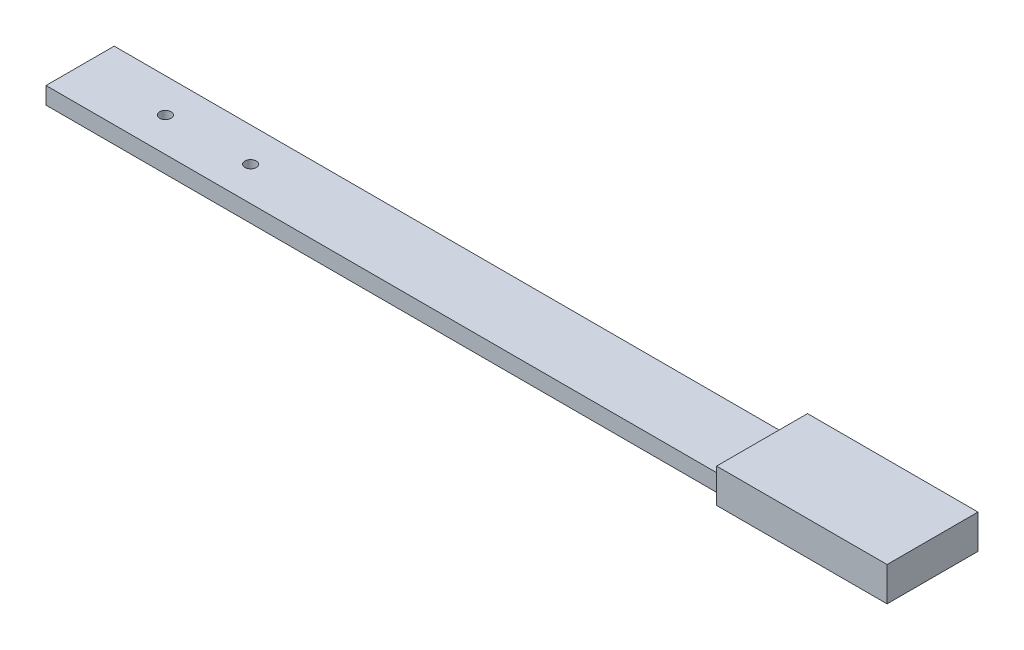
ISO-10303-21;
HEADER;
FILE_DESCRIPTION(('STEP AP214'),'2;1');
FILE_NAME('part.step','',(''),(''),'','','');
FILE_SCHEMA(('AUTOMOTIVE_DESIGN { 1 0 10303 214 1 1 1 1 }'));
ENDSEC;
DATA;
#1=APPLICATION_CONTEXT('core data for automotive mechanical design processes');
#2=APPLICATION_PROTOCOL_DEFINITION('international standard','automotive_design',2000,#1);
#3=PRODUCT_CONTEXT('',#1,'mechanical');
#4=PRODUCT('Part','Part','',(#3));
#5=PRODUCT_RELATED_PRODUCT_CATEGORY('part','',(#4));
#6=PRODUCT_DEFINITION_FORMATION('','',#4);
#7=PRODUCT_DEFINITION_CONTEXT('part definition',#1,'design');
#8=PRODUCT_DEFINITION('design','',#6,#7);
#9=PRODUCT_DEFINITION_SHAPE('','',#8);
#10=(LENGTH_UNIT() NAMED_UNIT(*) SI_UNIT(.MILLI.,.METRE.));
#11=(NAMED_UNIT(*) PLANE_ANGLE_UNIT() SI_UNIT($,.RADIAN.));
#12=(NAMED_UNIT(*) SI_UNIT($,.STERADIAN.) SOLID_ANGLE_UNIT());
#13=UNCERTAINTY_MEASURE_WITH_UNIT(LENGTH_MEASURE(1.E-05),#10,'distance_accuracy_value','');
#14=(GEOMETRIC_REPRESENTATION_CONTEXT(3) GLOBAL_UNCERTAINTY_ASSIGNED_CONTEXT((#13)) GLOBAL_UNIT_ASSIGNED_CONTEXT((#10,
#11,#12)) REPRESENTATION_CONTEXT('',''));
#15=CARTESIAN_POINT('',(0.,0.,0.));
#16=DIRECTION('',(0.,0.,1.));
#17=DIRECTION('',(1.,0.,0.));
#18=AXIS2_PLACEMENT_3D('',#15,#16,#17);
#19=CARTESIAN_POINT('',(-375.,-30.,40.));
#20=DIRECTION('',(0.,0.,1.));
#21=DIRECTION('',(1.,0.,0.));
#22=AXIS2_PLACEMENT_3D('',#19,#20,#21);
#23=PLANE('',#22);
#24=DIRECTION('',(1.,0.,0.));
#25=VECTOR('',#24,1.);
#26=CARTESIAN_POINT('',(-375.,0.,40.));
#27=LINE('',#26,#25);
#28=CARTESIAN_POINT('',(225.,0.,40.));
#29=VERTEX_POINT('',#28);
#30=CARTESIAN_POINT('',(375.,0.,40.));
#31=VERTEX_POINT('',#30);
#32=EDGE_CURVE('E70',#29,#31,#27,.T.);
#33=ORIENTED_EDGE('',*,*,#32,.F.);
#34=DIRECTION('',(0.,1.,0.));
#35=VECTOR('',#34,1.);
#36=CARTESIAN_POINT('',(225.,-30.,40.));
#37=LINE('',#36,#35);
#38=CARTESIAN_POINT('',(225.,-30.,40.));
#39=VERTEX_POINT('',#38);
#40=EDGE_CURVE('E49',#39,#29,#37,.T.);
#41=ORIENTED_EDGE('',*,*,#40,.F.);
#42=DIRECTION('',(1.,0.,0.));
#43=VECTOR('',#42,1.);
#44=CARTESIAN_POINT('',(-375.,-30.,40.));
#45=LINE('',#44,#43);
#46=CARTESIAN_POINT('',(375.,-30.,40.));
#47=VERTEX_POINT('',#46);
#48=EDGE_CURVE('E56',#39,#47,#45,.T.);
#49=ORIENTED_EDGE('',*,*,#48,.T.);
#50=DIRECTION('',(0.,1.,0.));
#51=VECTOR('',#50,1.);
#52=CARTESIAN_POINT('',(375.,-30.,40.));
#53=LINE('',#52,#51);
#54=EDGE_CURVE('E11',#47,#31,#53,.T.);
#55=ORIENTED_EDGE('',*,*,#54,.T.);
#56=EDGE_LOOP('',(#33,#41,#49,#55));
#57=FACE_BOUND('',#56,.T.);
#58=ADVANCED_FACE('F32',(#57),#23,.T.);
#59=CARTESIAN_POINT('',(-375.,-30.,-40.));
#60=DIRECTION('',(0.,0.,-1.));
#61=DIRECTION('',(-1.,0.,0.));
#62=AXIS2_PLACEMENT_3D('',#59,#60,#61);
#63=PLANE('',#62);
#64=DIRECTION('',(-1.,0.,0.));
#65=VECTOR('',#64,1.);
#66=CARTESIAN_POINT('',(-375.,-30.,-40.));
#67=LINE('',#66,#65);
#68=CARTESIAN_POINT('',(375.,-30.,-40.));
#69=VERTEX_POINT('',#68);
#70=CARTESIAN_POINT('',(225.,-30.,-40.));
#71=VERTEX_POINT('',#70);
#72=EDGE_CURVE('E93',#69,#71,#67,.T.);
#73=ORIENTED_EDGE('',*,*,#72,.T.);
#74=DIRECTION('',(0.,-1.,0.));
#75=VECTOR('',#74,1.);
#76=CARTESIAN_POINT('',(225.,0.,-40.));
#77=LINE('',#76,#75);
#78=CARTESIAN_POINT('',(225.,0.,-40.));
#79=VERTEX_POINT('',#78);
#80=EDGE_CURVE('E112',#79,#71,#77,.T.);
#81=ORIENTED_EDGE('',*,*,#80,.F.);
#82=DIRECTION('',(-1.,0.,0.));
#83=VECTOR('',#82,1.);
#84=CARTESIAN_POINT('',(-375.,0.,-40.));
#85=LINE('',#84,#83);
#86=CARTESIAN_POINT('',(375.,0.,-40.));
#87=VERTEX_POINT('',#86);
#88=EDGE_CURVE('E77',#87,#79,#85,.T.);
#89=ORIENTED_EDGE('',*,*,#88,.F.);
#90=DIRECTION('',(0.,1.,0.));
#91=VECTOR('',#90,1.);
#92=CARTESIAN_POINT('',(375.,-30.,-40.));
#93=LINE('',#92,#91);
#94=EDGE_CURVE('E41',#69,#87,#93,.T.);
#95=ORIENTED_EDGE('',*,*,#94,.F.);
#96=EDGE_LOOP('',(#73,#81,#89,#95));
#97=FACE_BOUND('',#96,.T.);
#98=ADVANCED_FACE('F190',(#97),#63,.T.);
#99=CARTESIAN_POINT('',(0.,0.,0.));
#100=DIRECTION('',(0.,-1.,0.));
#101=DIRECTION('',(0.,0.,-1.));
#102=AXIS2_PLACEMENT_3D('',#99,#100,#101);
#103=PLANE('',#102);
#104=DIRECTION('',(0.,0.,-1.));
#105=VECTOR('',#104,1.);
#106=CARTESIAN_POINT('',(225.,0.,40.));
#107=LINE('',#106,#105);
#108=EDGE_CURVE('E75',#29,#79,#107,.T.);
#109=ORIENTED_EDGE('',*,*,#108,.F.);
#110=ORIENTED_EDGE('',*,*,#32,.T.);
#111=DIRECTION('',(0.,0.,-1.));
#112=VECTOR('',#111,1.);
#113=CARTESIAN_POINT('',(375.,0.,40.));
#114=LINE('',#113,#112);
#115=EDGE_CURVE('E74',#31,#87,#114,.T.);
#116=ORIENTED_EDGE('',*,*,#115,.T.);
#117=ORIENTED_EDGE('',*,*,#88,.T.);
#118=EDGE_LOOP('',(#109,#110,#116,#117));
#119=FACE_BOUND('',#118,.T.);
#120=ADVANCED_FACE('F71',(#119),#103,.F.);
#121=CARTESIAN_POINT('',(375.,-30.,40.));
#122=DIRECTION('',(1.,0.,0.));
#123=DIRECTION('',(0.,0.,-1.));
#124=AXIS2_PLACEMENT_3D('',#121,#122,#123);
#125=PLANE('',#124);
#126=ORIENTED_EDGE('',*,*,#115,.F.);
#127=ORIENTED_EDGE('',*,*,#54,.F.);
#128=DIRECTION('',(0.,0.,-1.));
#129=VECTOR('',#128,1.);
#130=CARTESIAN_POINT('',(375.,-30.,40.));
#131=LINE('',#130,#129);
#132=EDGE_CURVE('E76',#47,#69,#131,.T.);
#133=ORIENTED_EDGE('',*,*,#132,.T.);
#134=ORIENTED_EDGE('',*,*,#94,.T.);
#135=EDGE_LOOP('',(#126,#127,#133,#134));
#136=FACE_BOUND('',#135,.T.);
#137=ADVANCED_FACE('F34',(#136),#125,.T.);
#138=CARTESIAN_POINT('',(-375.,-30.,40.));
#139=DIRECTION('',(-1.,0.,0.));
#140=DIRECTION('',(0.,0.,1.));
#141=AXIS2_PLACEMENT_3D('',#138,#139,#140);
#142=PLANE('',#141);
#143=DIRECTION('',(0.,-1.,0.));
#144=VECTOR('',#143,1.);
#145=CARTESIAN_POINT('',(-375.,-15.,30.));
#146=LINE('',#145,#144);
#147=CARTESIAN_POINT('',(-375.,-15.,30.));
#148=VERTEX_POINT('',#147);
#149=CARTESIAN_POINT('',(-375.,-30.,30.));
#150=VERTEX_POINT('',#149);
#151=EDGE_CURVE('E121',#148,#150,#146,.T.);
#152=ORIENTED_EDGE('',*,*,#151,.F.);
#153=DIRECTION('',(0.,0.,1.));
#154=VECTOR('',#153,1.);
#155=CARTESIAN_POINT('',(-375.,-15.,-30.));
#156=LINE('',#155,#154);
#157=CARTESIAN_POINT('',(-375.,-15.,-30.));
#158=VERTEX_POINT('',#157);
#159=EDGE_CURVE('E125',#158,#148,#156,.T.);
#160=ORIENTED_EDGE('',*,*,#159,.F.);
#161=DIRECTION('',(0.,1.,0.));
#162=VECTOR('',#161,1.);
#163=CARTESIAN_POINT('',(-375.,-30.,-30.));
#164=LINE('',#163,#162);
#165=CARTESIAN_POINT('',(-375.,-30.,-30.));
#166=VERTEX_POINT('',#165);
#167=EDGE_CURVE('E128',#166,#158,#164,.T.);
#168=ORIENTED_EDGE('',*,*,#167,.F.);
#169=DIRECTION('',(0.,0.,1.));
#170=VECTOR('',#169,1.);
#171=CARTESIAN_POINT('',(-375.,-30.,40.));
#172=LINE('',#171,#170);
#173=EDGE_CURVE('E91',#166,#150,#172,.T.);
#174=ORIENTED_EDGE('',*,*,#173,.T.);
#175=EDGE_LOOP('',(#152,#160,#168,#174));
#176=FACE_BOUND('',#175,.T.);
#177=ADVANCED_FACE('F166',(#176),#142,.T.);
#178=CARTESIAN_POINT('',(0.,-30.,0.));
#179=DIRECTION('',(0.,-1.,0.));
#180=DIRECTION('',(0.,0.,-1.));
#181=AXIS2_PLACEMENT_3D('',#178,#179,#180);
#182=PLANE('',#181);
#183=DIRECTION('',(-1.,0.,0.));
#184=VECTOR('',#183,1.);
#185=CARTESIAN_POINT('',(225.,-30.,30.));
#186=LINE('',#185,#184);
#187=CARTESIAN_POINT('',(225.,-30.,30.));
#188=VERTEX_POINT('',#187);
#189=EDGE_CURVE('E118',#188,#150,#186,.T.);
#190=ORIENTED_EDGE('',*,*,#189,.T.);
#191=ORIENTED_EDGE('',*,*,#173,.F.);
#192=DIRECTION('',(-1.,0.,0.));
#193=VECTOR('',#192,1.);
#194=CARTESIAN_POINT('',(225.,-30.,-30.));
#195=LINE('',#194,#193);
#196=CARTESIAN_POINT('',(225.,-30.,-30.));
#197=VERTEX_POINT('',#196);
#198=EDGE_CURVE('E108',#197,#166,#195,.T.);
#199=ORIENTED_EDGE('',*,*,#198,.F.);
#200=DIRECTION('',(0.,0.,1.));
#201=VECTOR('',#200,1.);
#202=CARTESIAN_POINT('',(225.,-30.,-40.));
#203=LINE('',#202,#201);
#204=EDGE_CURVE('E124',#71,#197,#203,.T.);
#205=ORIENTED_EDGE('',*,*,#204,.F.);
#206=ORIENTED_EDGE('',*,*,#72,.F.);
#207=ORIENTED_EDGE('',*,*,#132,.F.);
#208=ORIENTED_EDGE('',*,*,#48,.F.);
#209=DIRECTION('',(0.,0.,1.));
#210=VECTOR('',#209,1.);
#211=CARTESIAN_POINT('',(225.,-30.,30.));
#212=LINE('',#211,#210);
#213=EDGE_CURVE('E135',#188,#39,#212,.T.);
#214=ORIENTED_EDGE('',*,*,#213,.F.);
#215=EDGE_LOOP('',(#190,#191,#199,#205,#206,#207,#208,#214));
#216=FACE_BOUND('',#215,.T.);
#217=CARTESIAN_POINT('',(-225.,-30.,0.));
#218=DIRECTION('',(0.,1.,0.));
#219=DIRECTION('',(0.,0.,1.));
#220=AXIS2_PLACEMENT_3D('',#217,#218,#219);
#221=CIRCLE('',#220,4.99999999999999);
#222=CARTESIAN_POINT('',(-225.,-30.,5.));
#223=VERTEX_POINT('',#222);
#224=EDGE_CURVE('E87',#223,#223,#221,.T.);
#225=ORIENTED_EDGE('',*,*,#224,.T.);
#226=EDGE_LOOP('',(#225));
#227=FACE_BOUND('',#226,.T.);
#228=CARTESIAN_POINT('',(-300.,-30.,0.));
#229=DIRECTION('',(0.,1.,0.));
#230=DIRECTION('',(0.,0.,1.));
#231=AXIS2_PLACEMENT_3D('',#228,#229,#230);
#232=CIRCLE('',#231,4.99999999999999);
#233=CARTESIAN_POINT('',(-300.,-30.,5.));
#234=VERTEX_POINT('',#233);
#235=EDGE_CURVE('E83',#234,#234,#232,.T.);
#236=ORIENTED_EDGE('',*,*,#235,.T.);
#237=EDGE_LOOP('',(#236));
#238=FACE_BOUND('',#237,.T.);
#239=ADVANCED_FACE('F157',(#216,#227,#238),#182,.T.);
#240=CARTESIAN_POINT('',(-300.,-30.,0.));
#241=DIRECTION('',(0.,1.,0.));
#242=DIRECTION('',(0.,0.,1.));
#243=AXIS2_PLACEMENT_3D('',#240,#241,#242);
#244=CYLINDRICAL_SURFACE('',#243,4.99999999999999);
#245=CARTESIAN_POINT('',(-300.,-15.,0.));
#246=DIRECTION('',(0.,-1.,0.));
#247=DIRECTION('',(0.,0.,-1.));
#248=AXIS2_PLACEMENT_3D('',#245,#246,#247);
#249=CIRCLE('',#248,4.99999999999999);
#250=CARTESIAN_POINT('',(-300.,-15.,-4.99999999999998));
#251=VERTEX_POINT('',#250);
#252=EDGE_CURVE('E105',#251,#251,#249,.F.);
#253=ORIENTED_EDGE('',*,*,#252,.T.);
#254=EDGE_LOOP('',(#253));
#255=FACE_BOUND('',#254,.T.);
#256=ORIENTED_EDGE('',*,*,#235,.F.);
#257=EDGE_LOOP('',(#256));
#258=FACE_BOUND('',#257,.T.);
#259=ADVANCED_FACE('F203',(#255,#258),#244,.F.);
#260=CARTESIAN_POINT('',(-225.,-30.,0.));
#261=DIRECTION('',(0.,1.,0.));
#262=DIRECTION('',(0.,0.,1.));
#263=AXIS2_PLACEMENT_3D('',#260,#261,#262);
#264=CYLINDRICAL_SURFACE('',#263,4.99999999999999);
#265=CARTESIAN_POINT('',(-225.,-15.,0.));
#266=DIRECTION('',(0.,-1.,0.));
#267=DIRECTION('',(0.,0.,-1.));
#268=AXIS2_PLACEMENT_3D('',#265,#266,#267);
#269=CIRCLE('',#268,4.99999999999999);
#270=CARTESIAN_POINT('',(-225.,-15.,-4.99999999999998));
#271=VERTEX_POINT('',#270);
#272=EDGE_CURVE('E36',#271,#271,#269,.F.);
#273=ORIENTED_EDGE('',*,*,#272,.T.);
#274=EDGE_LOOP('',(#273));
#275=FACE_BOUND('',#274,.T.);
#276=ORIENTED_EDGE('',*,*,#224,.F.);
#277=EDGE_LOOP('',(#276));
#278=FACE_BOUND('',#277,.T.);
#279=ADVANCED_FACE('F206',(#275,#278),#264,.F.);
#280=CARTESIAN_POINT('',(225.,-15.,-30.));
#281=DIRECTION('',(0.,-1.,0.));
#282=DIRECTION('',(0.,0.,-1.));
#283=AXIS2_PLACEMENT_3D('',#280,#281,#282);
#284=PLANE('',#283);
#285=ORIENTED_EDGE('',*,*,#272,.F.);
#286=EDGE_LOOP('',(#285));
#287=FACE_BOUND('',#286,.T.);
#288=ORIENTED_EDGE('',*,*,#159,.T.);
#289=DIRECTION('',(-1.,0.,0.));
#290=VECTOR('',#289,1.);
#291=CARTESIAN_POINT('',(225.,-15.,30.));
#292=LINE('',#291,#290);
#293=CARTESIAN_POINT('',(225.,-15.,30.));
#294=VERTEX_POINT('',#293);
#295=EDGE_CURVE('E115',#294,#148,#292,.T.);
#296=ORIENTED_EDGE('',*,*,#295,.F.);
#297=DIRECTION('',(0.,0.,1.));
#298=VECTOR('',#297,1.);
#299=CARTESIAN_POINT('',(225.,-15.,-30.));
#300=LINE('',#299,#298);
#301=CARTESIAN_POINT('',(225.,-15.,-30.));
#302=VERTEX_POINT('',#301);
#303=EDGE_CURVE('E140',#302,#294,#300,.T.);
#304=ORIENTED_EDGE('',*,*,#303,.F.);
#305=DIRECTION('',(-1.,0.,0.));
#306=VECTOR('',#305,1.);
#307=CARTESIAN_POINT('',(225.,-15.,-30.));
#308=LINE('',#307,#306);
#309=EDGE_CURVE('E111',#302,#158,#308,.T.);
#310=ORIENTED_EDGE('',*,*,#309,.T.);
#311=EDGE_LOOP('',(#288,#296,#304,#310));
#312=FACE_BOUND('',#311,.T.);
#313=ORIENTED_EDGE('',*,*,#252,.F.);
#314=EDGE_LOOP('',(#313));
#315=FACE_BOUND('',#314,.T.);
#316=ADVANCED_FACE('F171',(#287,#312,#315),#284,.F.);
#317=CARTESIAN_POINT('',(225.,-15.,30.));
#318=DIRECTION('',(0.,0.,-1.));
#319=DIRECTION('',(0.,1.,0.));
#320=AXIS2_PLACEMENT_3D('',#317,#318,#319);
#321=PLANE('',#320);
#322=ORIENTED_EDGE('',*,*,#151,.T.);
#323=ORIENTED_EDGE('',*,*,#189,.F.);
#324=DIRECTION('',(0.,-1.,0.));
#325=VECTOR('',#324,1.);
#326=CARTESIAN_POINT('',(225.,-15.,30.));
#327=LINE('',#326,#325);
#328=EDGE_CURVE('E137',#294,#188,#327,.T.);
#329=ORIENTED_EDGE('',*,*,#328,.F.);
#330=ORIENTED_EDGE('',*,*,#295,.T.);
#331=EDGE_LOOP('',(#322,#323,#329,#330));
#332=FACE_BOUND('',#331,.T.);
#333=ADVANCED_FACE('F213',(#332),#321,.F.);
#334=CARTESIAN_POINT('',(225.,-30.,-30.));
#335=DIRECTION('',(0.,0.,1.));
#336=DIRECTION('',(1.,0.,0.));
#337=AXIS2_PLACEMENT_3D('',#334,#335,#336);
#338=PLANE('',#337);
#339=ORIENTED_EDGE('',*,*,#167,.T.);
#340=ORIENTED_EDGE('',*,*,#309,.F.);
#341=DIRECTION('',(0.,1.,0.));
#342=VECTOR('',#341,1.);
#343=CARTESIAN_POINT('',(225.,-30.,-30.));
#344=LINE('',#343,#342);
#345=EDGE_CURVE('E143',#197,#302,#344,.T.);
#346=ORIENTED_EDGE('',*,*,#345,.F.);
#347=ORIENTED_EDGE('',*,*,#198,.T.);
#348=EDGE_LOOP('',(#339,#340,#346,#347));
#349=FACE_BOUND('',#348,.T.);
#350=ADVANCED_FACE('F161',(#349),#338,.F.);
#351=CARTESIAN_POINT('',(225.,0.,0.));
#352=DIRECTION('',(-1.,0.,0.));
#353=DIRECTION('',(0.,0.,1.));
#354=AXIS2_PLACEMENT_3D('',#351,#352,#353);
#355=PLANE('',#354);
#356=ORIENTED_EDGE('',*,*,#204,.T.);
#357=ORIENTED_EDGE('',*,*,#345,.T.);
#358=ORIENTED_EDGE('',*,*,#303,.T.);
#359=ORIENTED_EDGE('',*,*,#328,.T.);
#360=ORIENTED_EDGE('',*,*,#213,.T.);
#361=ORIENTED_EDGE('',*,*,#40,.T.);
#362=ORIENTED_EDGE('',*,*,#108,.T.);
#363=ORIENTED_EDGE('',*,*,#80,.T.);
#364=EDGE_LOOP('',(#356,#357,#358,#359,#360,#361,#362,#363));
#365=FACE_BOUND('',#364,.T.);
#366=ADVANCED_FACE('F150',(#365),#355,.T.);
#367=CLOSED_SHELL('',(#58,#98,#120,#137,#177,#239,#259,#279,#316,#333,#350,#366));
#368=MANIFOLD_SOLID_BREP('B2',#367);
#369=ADVANCED_BREP_SHAPE_REPRESENTATION('',(#18,#368),#14);
#370=SHAPE_DEFINITION_REPRESENTATION(#9,#369);
ENDSEC;
END-ISO-10303-21;
